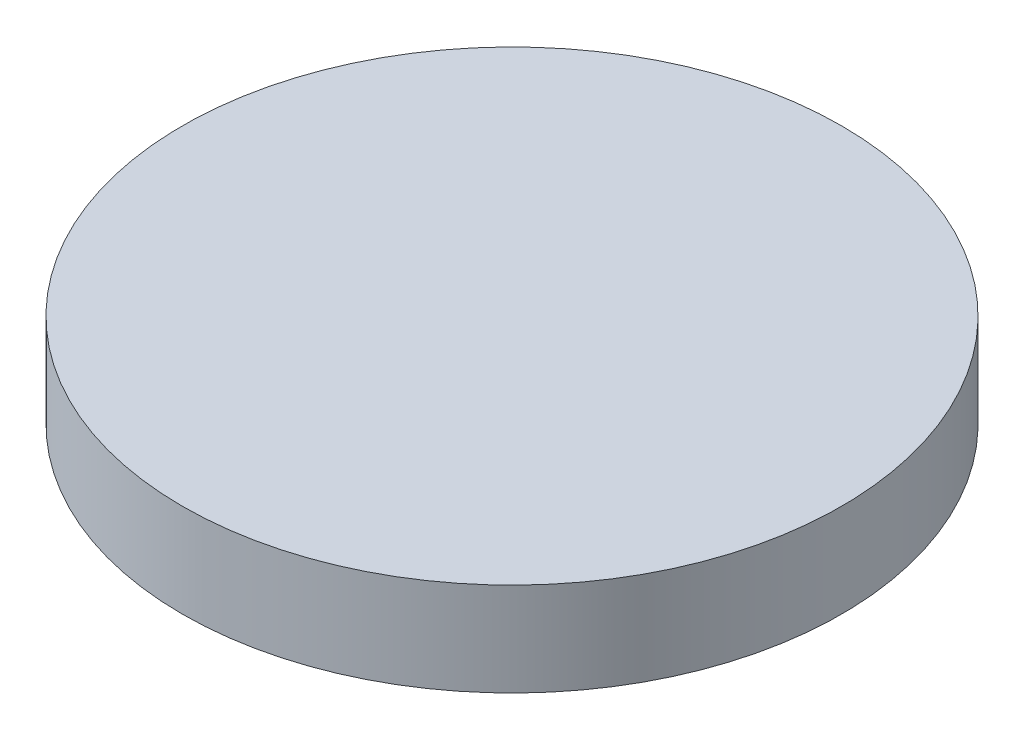
ISO-10303-21;
HEADER;
FILE_DESCRIPTION(('STEP AP214'),'2;1');
FILE_NAME('part.step','',(''),(''),'','','');
FILE_SCHEMA(('AUTOMOTIVE_DESIGN { 1 0 10303 214 1 1 1 1 }'));
ENDSEC;
DATA;
#1=APPLICATION_CONTEXT('core data for automotive mechanical design processes');
#2=APPLICATION_PROTOCOL_DEFINITION('international standard','automotive_design',2000,#1);
#3=PRODUCT_CONTEXT('',#1,'mechanical');
#4=PRODUCT('Part','Part','',(#3));
#5=PRODUCT_RELATED_PRODUCT_CATEGORY('part','',(#4));
#6=PRODUCT_DEFINITION_FORMATION('','',#4);
#7=PRODUCT_DEFINITION_CONTEXT('part definition',#1,'design');
#8=PRODUCT_DEFINITION('design','',#6,#7);
#9=PRODUCT_DEFINITION_SHAPE('','',#8);
#10=(LENGTH_UNIT() NAMED_UNIT(*) SI_UNIT(.MILLI.,.METRE.));
#11=(NAMED_UNIT(*) PLANE_ANGLE_UNIT() SI_UNIT($,.RADIAN.));
#12=(NAMED_UNIT(*) SI_UNIT($,.STERADIAN.) SOLID_ANGLE_UNIT());
#13=UNCERTAINTY_MEASURE_WITH_UNIT(LENGTH_MEASURE(1.E-05),#10,'distance_accuracy_value','');
#14=(GEOMETRIC_REPRESENTATION_CONTEXT(3) GLOBAL_UNCERTAINTY_ASSIGNED_CONTEXT((#13)) GLOBAL_UNIT_ASSIGNED_CONTEXT((#10,
#11,#12)) REPRESENTATION_CONTEXT('',''));
#15=CARTESIAN_POINT('',(0.,0.,0.));
#16=DIRECTION('',(0.,0.,1.));
#17=DIRECTION('',(1.,0.,0.));
#18=AXIS2_PLACEMENT_3D('',#15,#16,#17);
#19=CARTESIAN_POINT('',(0.,276.5,0.));
#20=DIRECTION('',(0.,-1.,0.));
#21=DIRECTION('',(0.,0.,-1.));
#22=AXIS2_PLACEMENT_3D('',#19,#20,#21);
#23=CYLINDRICAL_SURFACE('',#22,1950.);
#24=CARTESIAN_POINT('',(0.,276.5,0.));
#25=DIRECTION('',(0.,1.,0.));
#26=DIRECTION('',(0.,0.,1.));
#27=AXIS2_PLACEMENT_3D('',#24,#25,#26);
#28=CIRCLE('',#27,1950.);
#29=CARTESIAN_POINT('',(0.,276.5,1950.));
#30=VERTEX_POINT('',#29);
#31=EDGE_CURVE('E10',#30,#30,#28,.T.);
#32=ORIENTED_EDGE('',*,*,#31,.F.);
#33=EDGE_LOOP('',(#32));
#34=FACE_BOUND('',#33,.T.);
#35=CARTESIAN_POINT('',(0.,-276.5,0.));
#36=DIRECTION('',(0.,1.,0.));
#37=DIRECTION('',(0.,0.,1.));
#38=AXIS2_PLACEMENT_3D('',#35,#36,#37);
#39=CIRCLE('',#38,1950.);
#40=CARTESIAN_POINT('',(0.,-276.5,1950.));
#41=VERTEX_POINT('',#40);
#42=EDGE_CURVE('E38',#41,#41,#39,.T.);
#43=ORIENTED_EDGE('',*,*,#42,.T.);
#44=EDGE_LOOP('',(#43));
#45=FACE_BOUND('',#44,.T.);
#46=ADVANCED_FACE('F35',(#34,#45),#23,.T.);
#47=CARTESIAN_POINT('',(0.,276.5,0.));
#48=DIRECTION('',(0.,1.,0.));
#49=DIRECTION('',(0.,0.,1.));
#50=AXIS2_PLACEMENT_3D('',#47,#48,#49);
#51=PLANE('',#50);
#52=ORIENTED_EDGE('',*,*,#31,.T.);
#53=EDGE_LOOP('',(#52));
#54=FACE_BOUND('',#53,.T.);
#55=ADVANCED_FACE('F50',(#54),#51,.T.);
#56=CARTESIAN_POINT('',(0.,-276.5,0.));
#57=DIRECTION('',(0.,1.,0.));
#58=DIRECTION('',(0.,0.,1.));
#59=AXIS2_PLACEMENT_3D('',#56,#57,#58);
#60=PLANE('',#59);
#61=ORIENTED_EDGE('',*,*,#42,.F.);
#62=EDGE_LOOP('',(#61));
#63=FACE_BOUND('',#62,.T.);
#64=ADVANCED_FACE('F48',(#63),#60,.F.);
#65=CLOSED_SHELL('',(#46,#55,#64));
#66=MANIFOLD_SOLID_BREP('B2',#65);
#67=ADVANCED_BREP_SHAPE_REPRESENTATION('',(#18,#66),#14);
#68=SHAPE_DEFINITION_REPRESENTATION(#9,#67);
ENDSEC;
END-ISO-10303-21;
